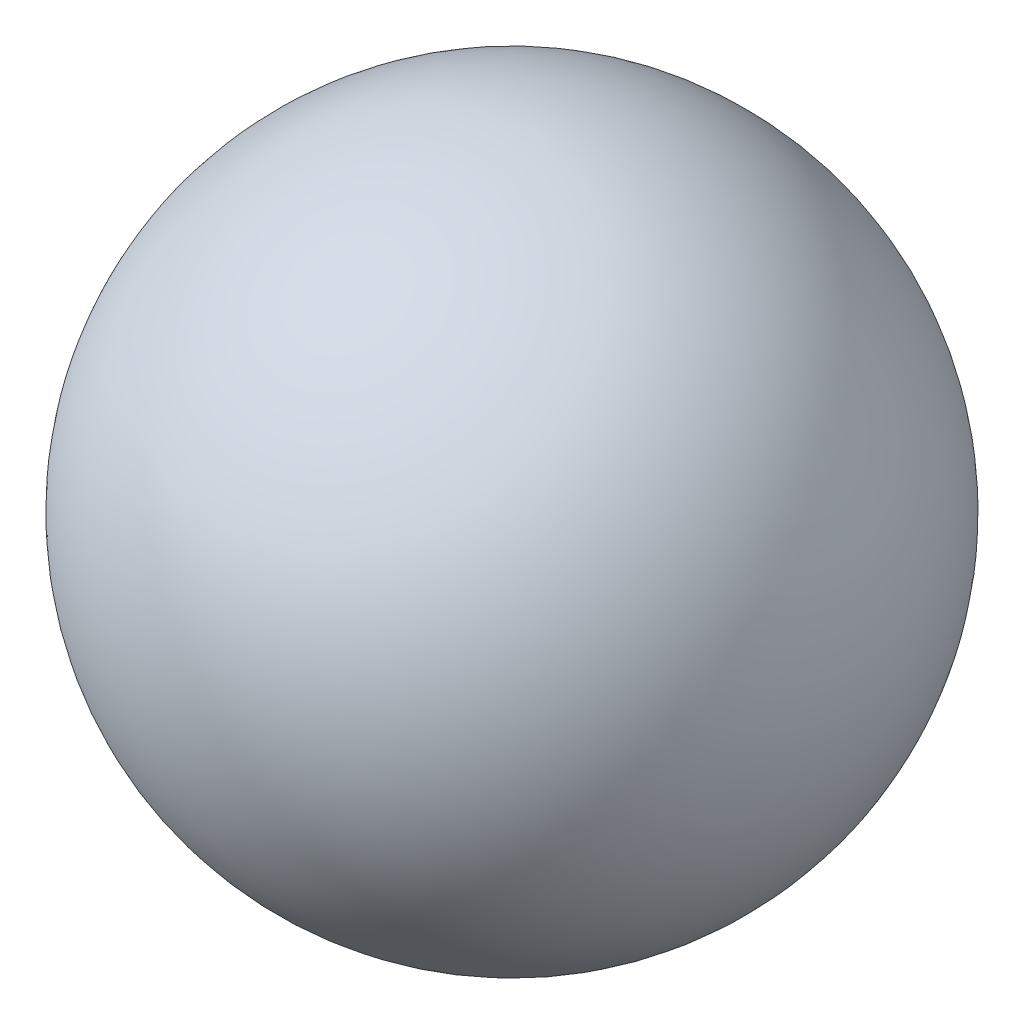
ISO-10303-21;
HEADER;
FILE_DESCRIPTION(('STEP AP214'),'2;1');
FILE_NAME('part.step','',(''),(''),'','','');
FILE_SCHEMA(('AUTOMOTIVE_DESIGN { 1 0 10303 214 1 1 1 1 }'));
ENDSEC;
DATA;
#1=APPLICATION_CONTEXT('core data for automotive mechanical design processes');
#2=APPLICATION_PROTOCOL_DEFINITION('international standard','automotive_design',2000,#1);
#3=PRODUCT_CONTEXT('',#1,'mechanical');
#4=PRODUCT('Part','Part','',(#3));
#5=PRODUCT_RELATED_PRODUCT_CATEGORY('part','',(#4));
#6=PRODUCT_DEFINITION_FORMATION('','',#4);
#7=PRODUCT_DEFINITION_CONTEXT('part definition',#1,'design');
#8=PRODUCT_DEFINITION('design','',#6,#7);
#9=PRODUCT_DEFINITION_SHAPE('','',#8);
#10=(LENGTH_UNIT() NAMED_UNIT(*) SI_UNIT(.MILLI.,.METRE.));
#11=(NAMED_UNIT(*) PLANE_ANGLE_UNIT() SI_UNIT($,.RADIAN.));
#12=(NAMED_UNIT(*) SI_UNIT($,.STERADIAN.) SOLID_ANGLE_UNIT());
#13=UNCERTAINTY_MEASURE_WITH_UNIT(LENGTH_MEASURE(1.E-05),#10,'distance_accuracy_value','');
#14=(GEOMETRIC_REPRESENTATION_CONTEXT(3) GLOBAL_UNCERTAINTY_ASSIGNED_CONTEXT((#13)) GLOBAL_UNIT_ASSIGNED_CONTEXT((#10,
#11,#12)) REPRESENTATION_CONTEXT('',''));
#15=CARTESIAN_POINT('',(0.,0.,0.));
#16=DIRECTION('',(0.,0.,1.));
#17=DIRECTION('',(1.,0.,0.));
#18=AXIS2_PLACEMENT_3D('',#15,#16,#17);
#19=CARTESIAN_POINT('',(0.,0.,0.));
#20=DIRECTION('',(-1.,0.,0.));
#21=DIRECTION('',(0.,1.,0.));
#22=AXIS2_PLACEMENT_3D('',#19,#20,#21);
#23=SPHERICAL_SURFACE('',#22,88.9);
#24=CARTESIAN_POINT('',(-88.9,0.,0.));
#25=VERTEX_POINT('',#24);
#26=VERTEX_LOOP('',#25);
#27=FACE_BOUND('',#26,.T.);
#28=ADVANCED_FACE('F29',(#27),#23,.T.);
#29=CLOSED_SHELL('',(#28));
#30=MANIFOLD_SOLID_BREP('B2',#29);
#31=ADVANCED_BREP_SHAPE_REPRESENTATION('',(#18,#30),#14);
#32=SHAPE_DEFINITION_REPRESENTATION(#9,#31);
ENDSEC;
END-ISO-10303-21;
